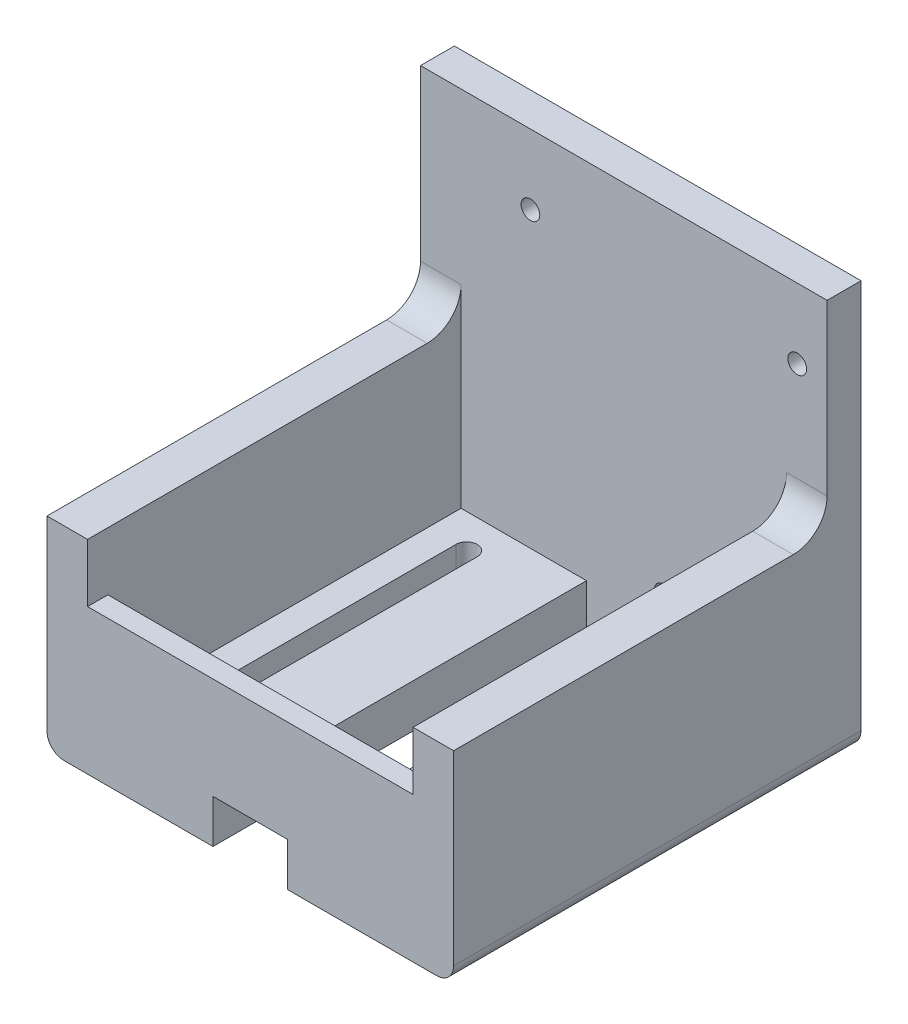
ISO-10303-21;
HEADER;
FILE_DESCRIPTION(('STEP AP214'),'2;1');
FILE_NAME('part.step','',(''),(''),'','','');
FILE_SCHEMA(('AUTOMOTIVE_DESIGN { 1 0 10303 214 1 1 1 1 }'));
ENDSEC;
DATA;
#1=APPLICATION_CONTEXT('core data for automotive mechanical design processes');
#2=APPLICATION_PROTOCOL_DEFINITION('international standard','automotive_design',2000,#1);
#3=PRODUCT_CONTEXT('',#1,'mechanical');
#4=PRODUCT('Part','Part','',(#3));
#5=PRODUCT_RELATED_PRODUCT_CATEGORY('part','',(#4));
#6=PRODUCT_DEFINITION_FORMATION('','',#4);
#7=PRODUCT_DEFINITION_CONTEXT('part definition',#1,'design');
#8=PRODUCT_DEFINITION('design','',#6,#7);
#9=PRODUCT_DEFINITION_SHAPE('','',#8);
#10=(LENGTH_UNIT() NAMED_UNIT(*) SI_UNIT(.MILLI.,.METRE.));
#11=(NAMED_UNIT(*) PLANE_ANGLE_UNIT() SI_UNIT($,.RADIAN.));
#12=(NAMED_UNIT(*) SI_UNIT($,.STERADIAN.) SOLID_ANGLE_UNIT());
#13=UNCERTAINTY_MEASURE_WITH_UNIT(LENGTH_MEASURE(1.E-05),#10,'distance_accuracy_value','');
#14=(GEOMETRIC_REPRESENTATION_CONTEXT(3) GLOBAL_UNCERTAINTY_ASSIGNED_CONTEXT((#13)) GLOBAL_UNIT_ASSIGNED_CONTEXT((#10,
#11,#12)) REPRESENTATION_CONTEXT('',''));
#15=CARTESIAN_POINT('',(0.,0.,0.));
#16=DIRECTION('',(0.,0.,1.));
#17=DIRECTION('',(1.,0.,0.));
#18=AXIS2_PLACEMENT_3D('',#15,#16,#17);
#19=CARTESIAN_POINT('',(76.2,8.1472457697771,76.350000086));
#20=DIRECTION('',(0.,1.,0.));
#21=DIRECTION('',(0.,0.,1.));
#22=AXIS2_PLACEMENT_3D('',#19,#20,#21);
#23=PLANE('',#22);
#24=DIRECTION('',(0.,0.,-1.));
#25=VECTOR('',#24,1.);
#26=CARTESIAN_POINT('',(59.22,8.1472457697771,12.7));
#27=LINE('',#26,#25);
#28=CARTESIAN_POINT('',(59.22,8.1472457697771,70.000000086));
#29=VERTEX_POINT('',#28);
#30=CARTESIAN_POINT('',(59.22,8.1472457697771,12.7));
#31=VERTEX_POINT('',#30);
#32=EDGE_CURVE('E464',#29,#31,#27,.T.);
#33=ORIENTED_EDGE('',*,*,#32,.T.);
#34=CARTESIAN_POINT('',(61.22,8.1472457697771,12.7));
#35=DIRECTION('',(0.,-1.,0.));
#36=DIRECTION('',(0.,0.,1.));
#37=AXIS2_PLACEMENT_3D('',#34,#35,#36);
#38=CIRCLE('',#37,2.);
#39=CARTESIAN_POINT('',(63.22,8.1472457697771,12.7));
#40=VERTEX_POINT('',#39);
#41=EDGE_CURVE('E460',#31,#40,#38,.T.);
#42=ORIENTED_EDGE('',*,*,#41,.T.);
#43=DIRECTION('',(0.,0.,1.));
#44=VECTOR('',#43,1.);
#45=CARTESIAN_POINT('',(63.22,8.1472457697771,12.7));
#46=LINE('',#45,#44);
#47=CARTESIAN_POINT('',(63.22,8.1472457697771,70.000000086));
#48=VERTEX_POINT('',#47);
#49=EDGE_CURVE('E481',#40,#48,#46,.T.);
#50=ORIENTED_EDGE('',*,*,#49,.T.);
#51=CARTESIAN_POINT('',(61.22,8.1472457697771,70.000000086));
#52=DIRECTION('',(0.,-1.,0.));
#53=DIRECTION('',(0.,0.,1.));
#54=AXIS2_PLACEMENT_3D('',#51,#52,#53);
#55=CIRCLE('',#54,2.);
#56=EDGE_CURVE('E477',#48,#29,#55,.T.);
#57=ORIENTED_EDGE('',*,*,#56,.T.);
#58=EDGE_LOOP('',(#33,#42,#50,#57));
#59=FACE_BOUND('',#58,.T.);
#60=DIRECTION('',(0.,0.,-1.));
#61=VECTOR('',#60,1.);
#62=CARTESIAN_POINT('',(45.1,8.1472457697771,76.350000086));
#63=LINE('',#62,#61);
#64=CARTESIAN_POINT('',(45.1,8.1472457697771,72.540000086));
#65=VERTEX_POINT('',#64);
#66=CARTESIAN_POINT('',(45.1,8.1472457697771,18.558822598954));
#67=VERTEX_POINT('',#66);
#68=EDGE_CURVE('E60',#65,#67,#63,.T.);
#69=ORIENTED_EDGE('',*,*,#68,.F.);
#70=DIRECTION('',(-1.,0.,0.));
#71=VECTOR('',#70,1.);
#72=CARTESIAN_POINT('',(7.60000000000001,8.1472457697771,72.540000086));
#73=LINE('',#72,#71);
#74=CARTESIAN_POINT('',(68.6,8.1472457697771,72.540000086));
#75=VERTEX_POINT('',#74);
#76=EDGE_CURVE('E269',#75,#65,#73,.T.);
#77=ORIENTED_EDGE('',*,*,#76,.F.);
#78=DIRECTION('',(0.,0.,-1.));
#79=VECTOR('',#78,1.);
#80=CARTESIAN_POINT('',(68.6,8.1472457697771,76.350000086));
#81=LINE('',#80,#79);
#82=CARTESIAN_POINT('',(68.6,8.1472457697771,6.35));
#83=VERTEX_POINT('',#82);
#84=EDGE_CURVE('E528',#75,#83,#81,.T.);
#85=ORIENTED_EDGE('',*,*,#84,.T.);
#86=DIRECTION('',(1.,0.,0.));
#87=VECTOR('',#86,1.);
#88=CARTESIAN_POINT('',(76.2,8.1472457697771,6.35));
#89=LINE('',#88,#87);
#90=CARTESIAN_POINT('',(48.91,8.1472457697771,6.35));
#91=VERTEX_POINT('',#90);
#92=EDGE_CURVE('E452',#91,#83,#89,.T.);
#93=ORIENTED_EDGE('',*,*,#92,.F.);
#94=DIRECTION('',(0.,0.,-1.));
#95=VECTOR('',#94,1.);
#96=CARTESIAN_POINT('',(48.91,8.1472457697771,76.350000086));
#97=LINE('',#96,#95);
#98=CARTESIAN_POINT('',(48.91,8.1472457697771,18.558822598954));
#99=VERTEX_POINT('',#98);
#100=EDGE_CURVE('E53',#91,#99,#97,.F.);
#101=ORIENTED_EDGE('',*,*,#100,.T.);
#102=DIRECTION('',(-1.,0.,0.));
#103=VECTOR('',#102,1.);
#104=CARTESIAN_POINT('',(76.2,8.1472457697771,18.558822598954));
#105=LINE('',#104,#103);
#106=EDGE_CURVE('E443',#99,#67,#105,.T.);
#107=ORIENTED_EDGE('',*,*,#106,.T.);
#108=EDGE_LOOP('',(#69,#77,#85,#93,#101,#107));
#109=FACE_BOUND('',#108,.T.);
#110=ADVANCED_FACE('F43',(#59,#109),#23,.T.);
#111=CARTESIAN_POINT('',(0.,8.1472457697771,76.350000086));
#112=DIRECTION('',(0.,-1.,0.));
#113=DIRECTION('',(0.,0.,-1.));
#114=AXIS2_PLACEMENT_3D('',#111,#112,#113);
#115=PLANE('',#114);
#116=DIRECTION('',(0.,0.,1.));
#117=VECTOR('',#116,1.);
#118=CARTESIAN_POINT('',(12.98,8.1472457697771,12.7));
#119=LINE('',#118,#117);
#120=CARTESIAN_POINT('',(12.98,8.1472457697771,12.7));
#121=VERTEX_POINT('',#120);
#122=CARTESIAN_POINT('',(12.98,8.1472457697771,70.000000086));
#123=VERTEX_POINT('',#122);
#124=EDGE_CURVE('E557',#121,#123,#119,.T.);
#125=ORIENTED_EDGE('',*,*,#124,.F.);
#126=CARTESIAN_POINT('',(14.98,8.1472457697771,12.7));
#127=DIRECTION('',(0.,1.,0.));
#128=DIRECTION('',(0.,0.,1.));
#129=AXIS2_PLACEMENT_3D('',#126,#127,#128);
#130=CIRCLE('',#129,2.);
#131=CARTESIAN_POINT('',(16.98,8.1472457697771,12.7));
#132=VERTEX_POINT('',#131);
#133=EDGE_CURVE('E554',#132,#121,#130,.T.);
#134=ORIENTED_EDGE('',*,*,#133,.F.);
#135=DIRECTION('',(0.,0.,-1.));
#136=VECTOR('',#135,1.);
#137=CARTESIAN_POINT('',(16.98,8.1472457697771,12.7));
#138=LINE('',#137,#136);
#139=CARTESIAN_POINT('',(16.98,8.1472457697771,70.000000086));
#140=VERTEX_POINT('',#139);
#141=EDGE_CURVE('E565',#140,#132,#138,.T.);
#142=ORIENTED_EDGE('',*,*,#141,.F.);
#143=CARTESIAN_POINT('',(14.98,8.1472457697771,70.000000086));
#144=DIRECTION('',(0.,1.,0.));
#145=DIRECTION('',(0.,0.,1.));
#146=AXIS2_PLACEMENT_3D('',#143,#144,#145);
#147=CIRCLE('',#146,2.);
#148=EDGE_CURVE('E561',#123,#140,#147,.T.);
#149=ORIENTED_EDGE('',*,*,#148,.F.);
#150=EDGE_LOOP('',(#125,#134,#142,#149));
#151=FACE_BOUND('',#150,.T.);
#152=CARTESIAN_POINT('',(31.1,8.1472457697771,72.540000086));
#153=VERTEX_POINT('',#152);
#154=CARTESIAN_POINT('',(7.60000000000001,8.1472457697771,72.540000086));
#155=VERTEX_POINT('',#154);
#156=EDGE_CURVE('E1031',#153,#155,#73,.T.);
#157=ORIENTED_EDGE('',*,*,#156,.F.);
#158=DIRECTION('',(0.,0.,-1.));
#159=VECTOR('',#158,1.);
#160=CARTESIAN_POINT('',(31.1,8.1472457697771,76.350000086));
#161=LINE('',#160,#159);
#162=CARTESIAN_POINT('',(31.1,8.1472457697771,6.35));
#163=VERTEX_POINT('',#162);
#164=EDGE_CURVE('E300',#153,#163,#161,.T.);
#165=ORIENTED_EDGE('',*,*,#164,.T.);
#166=DIRECTION('',(-1.,0.,0.));
#167=VECTOR('',#166,1.);
#168=CARTESIAN_POINT('',(0.,8.1472457697771,6.35));
#169=LINE('',#168,#167);
#170=CARTESIAN_POINT('',(7.60000000000001,8.1472457697771,6.35));
#171=VERTEX_POINT('',#170);
#172=EDGE_CURVE('E301',#163,#171,#169,.T.);
#173=ORIENTED_EDGE('',*,*,#172,.T.);
#174=DIRECTION('',(0.,0.,-1.));
#175=VECTOR('',#174,1.);
#176=CARTESIAN_POINT('',(7.60000000000001,8.1472457697771,76.350000086));
#177=LINE('',#176,#175);
#178=EDGE_CURVE('E320',#155,#171,#177,.T.);
#179=ORIENTED_EDGE('',*,*,#178,.F.);
#180=EDGE_LOOP('',(#157,#165,#173,#179));
#181=FACE_BOUND('',#180,.T.);
#182=ADVANCED_FACE('F609',(#151,#181),#115,.F.);
#183=CARTESIAN_POINT('',(7.60000000000001,0.,76.350000086));
#184=DIRECTION('',(-1.,0.,0.));
#185=DIRECTION('',(0.,0.,1.));
#186=AXIS2_PLACEMENT_3D('',#183,#184,#185);
#187=PLANE('',#186);
#188=DIRECTION('',(0.,-1.,0.));
#189=VECTOR('',#188,1.);
#190=CARTESIAN_POINT('',(7.60000000000001,27.1972457697771,72.540000086));
#191=LINE('',#190,#189);
#192=CARTESIAN_POINT('',(7.60000000000001,27.1972457697771,72.540000086));
#193=VERTEX_POINT('',#192);
#194=EDGE_CURVE('E466',#193,#155,#191,.T.);
#195=ORIENTED_EDGE('',*,*,#194,.T.);
#196=ORIENTED_EDGE('',*,*,#178,.T.);
#197=DIRECTION('',(0.,1.,0.));
#198=VECTOR('',#197,1.);
#199=CARTESIAN_POINT('',(7.60000000000001,0.,6.35));
#200=LINE('',#199,#198);
#201=CARTESIAN_POINT('',(7.60000000000001,44.45,6.35));
#202=VERTEX_POINT('',#201);
#203=EDGE_CURVE('E284',#171,#202,#200,.T.);
#204=ORIENTED_EDGE('',*,*,#203,.T.);
#205=CARTESIAN_POINT('',(7.60000000000001,44.45,12.7));
#206=DIRECTION('',(-1.,0.,0.));
#207=DIRECTION('',(0.,0.,1.));
#208=AXIS2_PLACEMENT_3D('',#205,#206,#207);
#209=CIRCLE('',#208,6.35);
#210=CARTESIAN_POINT('',(7.60000000000001,38.1,12.7));
#211=VERTEX_POINT('',#210);
#212=EDGE_CURVE('E407',#202,#211,#209,.T.);
#213=ORIENTED_EDGE('',*,*,#212,.T.);
#214=DIRECTION('',(0.,0.,-1.));
#215=VECTOR('',#214,1.);
#216=CARTESIAN_POINT('',(7.60000000000001,38.1,76.350000086));
#217=LINE('',#216,#215);
#218=CARTESIAN_POINT('',(7.60000000000001,38.1,76.350000086));
#219=VERTEX_POINT('',#218);
#220=EDGE_CURVE('E273',#219,#211,#217,.T.);
#221=ORIENTED_EDGE('',*,*,#220,.F.);
#222=DIRECTION('',(0.,1.,0.));
#223=VECTOR('',#222,1.);
#224=CARTESIAN_POINT('',(7.60000000000001,0.,76.350000086));
#225=LINE('',#224,#223);
#226=CARTESIAN_POINT('',(7.60000000000001,27.1972457697771,76.350000086));
#227=VERTEX_POINT('',#226);
#228=EDGE_CURVE('E252',#227,#219,#225,.T.);
#229=ORIENTED_EDGE('',*,*,#228,.F.);
#230=DIRECTION('',(0.,0.,1.));
#231=VECTOR('',#230,1.);
#232=CARTESIAN_POINT('',(7.60000000000001,27.1972457697771,76.350000086));
#233=LINE('',#232,#231);
#234=EDGE_CURVE('E259',#193,#227,#233,.T.);
#235=ORIENTED_EDGE('',*,*,#234,.F.);
#236=EDGE_LOOP('',(#195,#196,#204,#213,#221,#229,#235));
#237=FACE_BOUND('',#236,.T.);
#238=ADVANCED_FACE('F271',(#237),#187,.F.);
#239=CARTESIAN_POINT('',(68.6,0.,76.350000086));
#240=DIRECTION('',(-1.,0.,0.));
#241=DIRECTION('',(0.,0.,1.));
#242=AXIS2_PLACEMENT_3D('',#239,#240,#241);
#243=PLANE('',#242);
#244=ORIENTED_EDGE('',*,*,#84,.F.);
#245=DIRECTION('',(0.,-1.,0.));
#246=VECTOR('',#245,1.);
#247=CARTESIAN_POINT('',(68.6,27.1972457697771,72.540000086));
#248=LINE('',#247,#246);
#249=CARTESIAN_POINT('',(68.6,27.1972457697771,72.540000086));
#250=VERTEX_POINT('',#249);
#251=EDGE_CURVE('E68',#250,#75,#248,.T.);
#252=ORIENTED_EDGE('',*,*,#251,.F.);
#253=DIRECTION('',(0.,0.,-1.));
#254=VECTOR('',#253,1.);
#255=CARTESIAN_POINT('',(68.6,27.1972457697771,76.350000086));
#256=LINE('',#255,#254);
#257=CARTESIAN_POINT('',(68.6,27.1972457697771,76.350000086));
#258=VERTEX_POINT('',#257);
#259=EDGE_CURVE('E258',#258,#250,#256,.T.);
#260=ORIENTED_EDGE('',*,*,#259,.F.);
#261=DIRECTION('',(0.,1.,0.));
#262=VECTOR('',#261,1.);
#263=CARTESIAN_POINT('',(68.6,0.,76.350000086));
#264=LINE('',#263,#262);
#265=CARTESIAN_POINT('',(68.6,38.1,76.350000086));
#266=VERTEX_POINT('',#265);
#267=EDGE_CURVE('E255',#258,#266,#264,.T.);
#268=ORIENTED_EDGE('',*,*,#267,.T.);
#269=DIRECTION('',(0.,0.,-1.));
#270=VECTOR('',#269,1.);
#271=CARTESIAN_POINT('',(68.6,38.1,76.350000086));
#272=LINE('',#271,#270);
#273=CARTESIAN_POINT('',(68.6,38.1,12.7));
#274=VERTEX_POINT('',#273);
#275=EDGE_CURVE('E539',#266,#274,#272,.T.);
#276=ORIENTED_EDGE('',*,*,#275,.T.);
#277=CARTESIAN_POINT('',(68.6,44.45,12.7));
#278=DIRECTION('',(-1.,0.,0.));
#279=DIRECTION('',(0.,0.,1.));
#280=AXIS2_PLACEMENT_3D('',#277,#278,#279);
#281=CIRCLE('',#280,6.35);
#282=CARTESIAN_POINT('',(68.6,44.45,6.35));
#283=VERTEX_POINT('',#282);
#284=EDGE_CURVE('E400',#274,#283,#281,.F.);
#285=ORIENTED_EDGE('',*,*,#284,.T.);
#286=DIRECTION('',(0.,1.,0.));
#287=VECTOR('',#286,1.);
#288=CARTESIAN_POINT('',(68.6,0.,6.35));
#289=LINE('',#288,#287);
#290=EDGE_CURVE('E515',#83,#283,#289,.T.);
#291=ORIENTED_EDGE('',*,*,#290,.F.);
#292=EDGE_LOOP('',(#244,#252,#260,#268,#276,#285,#291));
#293=FACE_BOUND('',#292,.T.);
#294=ADVANCED_FACE('F641',(#293),#243,.T.);
#295=CARTESIAN_POINT('',(0.,0.,6.35));
#296=DIRECTION('',(0.,1.,0.));
#297=DIRECTION('',(0.,0.,1.));
#298=AXIS2_PLACEMENT_3D('',#295,#296,#297);
#299=PLANE('',#298);
#300=DIRECTION('',(1.,0.,0.));
#301=VECTOR('',#300,1.);
#302=CARTESIAN_POINT('',(0.,0.,76.350000086));
#303=LINE('',#302,#301);
#304=CARTESIAN_POINT('',(3.175,0.,76.350000086));
#305=VERTEX_POINT('',#304);
#306=CARTESIAN_POINT('',(31.1,0.,76.350000086));
#307=VERTEX_POINT('',#306);
#308=EDGE_CURVE('E293',#305,#307,#303,.T.);
#309=ORIENTED_EDGE('',*,*,#308,.F.);
#310=DIRECTION('',(0.,0.,-1.));
#311=VECTOR('',#310,1.);
#312=CARTESIAN_POINT('',(3.175,0.,6.35));
#313=LINE('',#312,#311);
#314=CARTESIAN_POINT('',(3.175,0.,0.));
#315=VERTEX_POINT('',#314);
#316=EDGE_CURVE('E413',#305,#315,#313,.T.);
#317=ORIENTED_EDGE('',*,*,#316,.T.);
#318=DIRECTION('',(1.,0.,0.));
#319=VECTOR('',#318,1.);
#320=CARTESIAN_POINT('',(0.,0.,0.));
#321=LINE('',#320,#319);
#322=CARTESIAN_POINT('',(73.025,0.,0.));
#323=VERTEX_POINT('',#322);
#324=EDGE_CURVE('E366',#315,#323,#321,.T.);
#325=ORIENTED_EDGE('',*,*,#324,.T.);
#326=DIRECTION('',(0.,0.,-1.));
#327=VECTOR('',#326,1.);
#328=CARTESIAN_POINT('',(73.025,0.,6.35));
#329=LINE('',#328,#327);
#330=CARTESIAN_POINT('',(73.025,0.,76.350000086));
#331=VERTEX_POINT('',#330);
#332=EDGE_CURVE('E410',#323,#331,#329,.F.);
#333=ORIENTED_EDGE('',*,*,#332,.T.);
#334=DIRECTION('',(-1.,0.,0.));
#335=VECTOR('',#334,1.);
#336=CARTESIAN_POINT('',(76.2,0.,76.350000086));
#337=LINE('',#336,#335);
#338=CARTESIAN_POINT('',(45.1,0.,76.350000086));
#339=VERTEX_POINT('',#338);
#340=EDGE_CURVE('E514',#331,#339,#337,.T.);
#341=ORIENTED_EDGE('',*,*,#340,.T.);
#342=DIRECTION('',(0.,0.,-1.));
#343=VECTOR('',#342,1.);
#344=CARTESIAN_POINT('',(45.1,0.,76.350000086));
#345=LINE('',#344,#343);
#346=CARTESIAN_POINT('',(45.1,0.,6.35));
#347=VERTEX_POINT('',#346);
#348=EDGE_CURVE('E547',#339,#347,#345,.T.);
#349=ORIENTED_EDGE('',*,*,#348,.T.);
#350=DIRECTION('',(1.,0.,0.));
#351=VECTOR('',#350,1.);
#352=CARTESIAN_POINT('',(0.,0.,6.35));
#353=LINE('',#352,#351);
#354=CARTESIAN_POINT('',(31.1,0.,6.35));
#355=VERTEX_POINT('',#354);
#356=EDGE_CURVE('E352',#355,#347,#353,.T.);
#357=ORIENTED_EDGE('',*,*,#356,.F.);
#358=DIRECTION('',(0.,0.,-1.));
#359=VECTOR('',#358,1.);
#360=CARTESIAN_POINT('',(31.1,0.,76.350000086));
#361=LINE('',#360,#359);
#362=EDGE_CURVE('E310',#307,#355,#361,.T.);
#363=ORIENTED_EDGE('',*,*,#362,.F.);
#364=EDGE_LOOP('',(#309,#317,#325,#333,#341,#349,#357,#363));
#365=FACE_BOUND('',#364,.T.);
#366=DIRECTION('',(0.,0.,-1.));
#367=VECTOR('',#366,1.);
#368=CARTESIAN_POINT('',(16.98,0.,6.35));
#369=LINE('',#368,#367);
#370=CARTESIAN_POINT('',(16.98,0.,70.000000086));
#371=VERTEX_POINT('',#370);
#372=CARTESIAN_POINT('',(16.98,0.,12.7));
#373=VERTEX_POINT('',#372);
#374=EDGE_CURVE('E589',#371,#373,#369,.T.);
#375=ORIENTED_EDGE('',*,*,#374,.T.);
#376=CARTESIAN_POINT('',(14.98,0.,12.7));
#377=DIRECTION('',(0.,1.,0.));
#378=DIRECTION('',(0.,0.,1.));
#379=AXIS2_PLACEMENT_3D('',#376,#377,#378);
#380=CIRCLE('',#379,2.);
#381=CARTESIAN_POINT('',(12.98,0.,12.7));
#382=VERTEX_POINT('',#381);
#383=EDGE_CURVE('E287',#373,#382,#380,.T.);
#384=ORIENTED_EDGE('',*,*,#383,.T.);
#385=DIRECTION('',(0.,0.,1.));
#386=VECTOR('',#385,1.);
#387=CARTESIAN_POINT('',(12.98,0.,6.35));
#388=LINE('',#387,#386);
#389=CARTESIAN_POINT('',(12.98,0.,70.000000086));
#390=VERTEX_POINT('',#389);
#391=EDGE_CURVE('E573',#382,#390,#388,.T.);
#392=ORIENTED_EDGE('',*,*,#391,.T.);
#393=CARTESIAN_POINT('',(14.98,0.,70.000000086));
#394=DIRECTION('',(0.,1.,0.));
#395=DIRECTION('',(0.,0.,1.));
#396=AXIS2_PLACEMENT_3D('',#393,#394,#395);
#397=CIRCLE('',#396,2.);
#398=EDGE_CURVE('E586',#390,#371,#397,.T.);
#399=ORIENTED_EDGE('',*,*,#398,.T.);
#400=EDGE_LOOP('',(#375,#384,#392,#399));
#401=FACE_BOUND('',#400,.T.);
#402=CARTESIAN_POINT('',(61.22,0.,12.7));
#403=DIRECTION('',(0.,1.,0.));
#404=DIRECTION('',(0.,0.,1.));
#405=AXIS2_PLACEMENT_3D('',#402,#403,#404);
#406=CIRCLE('',#405,2.);
#407=CARTESIAN_POINT('',(59.22,0.,12.7));
#408=VERTEX_POINT('',#407);
#409=CARTESIAN_POINT('',(63.22,0.,12.7));
#410=VERTEX_POINT('',#409);
#411=EDGE_CURVE('E508',#408,#410,#406,.F.);
#412=ORIENTED_EDGE('',*,*,#411,.F.);
#413=DIRECTION('',(0.,0.,-1.));
#414=VECTOR('',#413,1.);
#415=CARTESIAN_POINT('',(59.22,0.,6.35000000000001));
#416=LINE('',#415,#414);
#417=CARTESIAN_POINT('',(59.22,0.,70.000000086));
#418=VERTEX_POINT('',#417);
#419=EDGE_CURVE('E489',#418,#408,#416,.T.);
#420=ORIENTED_EDGE('',*,*,#419,.F.);
#421=CARTESIAN_POINT('',(61.22,0.,70.000000086));
#422=DIRECTION('',(0.,1.,0.));
#423=DIRECTION('',(0.,0.,1.));
#424=AXIS2_PLACEMENT_3D('',#421,#422,#423);
#425=CIRCLE('',#424,2.);
#426=CARTESIAN_POINT('',(63.22,0.,70.000000086));
#427=VERTEX_POINT('',#426);
#428=EDGE_CURVE('E501',#427,#418,#425,.F.);
#429=ORIENTED_EDGE('',*,*,#428,.F.);
#430=DIRECTION('',(0.,0.,1.));
#431=VECTOR('',#430,1.);
#432=CARTESIAN_POINT('',(63.22,0.,6.35000000000001));
#433=LINE('',#432,#431);
#434=EDGE_CURVE('E505',#410,#427,#433,.T.);
#435=ORIENTED_EDGE('',*,*,#434,.F.);
#436=EDGE_LOOP('',(#412,#420,#429,#435));
#437=FACE_BOUND('',#436,.T.);
#438=ADVANCED_FACE('F595',(#365,#401,#437),#299,.F.);
#439=CARTESIAN_POINT('',(0.,0.,6.35));
#440=DIRECTION('',(0.,0.,-1.));
#441=DIRECTION('',(-1.,0.,0.));
#442=AXIS2_PLACEMENT_3D('',#439,#440,#441);
#443=PLANE('',#442);
#444=ORIENTED_EDGE('',*,*,#290,.T.);
#445=DIRECTION('',(1.,0.,0.));
#446=VECTOR('',#445,1.);
#447=CARTESIAN_POINT('',(0.,44.45,6.35));
#448=LINE('',#447,#446);
#449=CARTESIAN_POINT('',(76.2,44.45,6.35));
#450=VERTEX_POINT('',#449);
#451=EDGE_CURVE('E386',#283,#450,#448,.T.);
#452=ORIENTED_EDGE('',*,*,#451,.T.);
#453=DIRECTION('',(0.,1.,0.));
#454=VECTOR('',#453,1.);
#455=CARTESIAN_POINT('',(76.2,0.,6.35));
#456=LINE('',#455,#454);
#457=CARTESIAN_POINT('',(76.2,76.2,6.35));
#458=VERTEX_POINT('',#457);
#459=EDGE_CURVE('E356',#450,#458,#456,.T.);
#460=ORIENTED_EDGE('',*,*,#459,.T.);
#461=DIRECTION('',(-1.,0.,0.));
#462=VECTOR('',#461,1.);
#463=CARTESIAN_POINT('',(0.,76.2,6.35));
#464=LINE('',#463,#462);
#465=CARTESIAN_POINT('',(0.,76.2,6.35));
#466=VERTEX_POINT('',#465);
#467=EDGE_CURVE('E359',#458,#466,#464,.T.);
#468=ORIENTED_EDGE('',*,*,#467,.T.);
#469=DIRECTION('',(0.,-1.,0.));
#470=VECTOR('',#469,1.);
#471=CARTESIAN_POINT('',(0.,0.,6.35));
#472=LINE('',#471,#470);
#473=CARTESIAN_POINT('',(0.,44.45,6.35));
#474=VERTEX_POINT('',#473);
#475=EDGE_CURVE('E348',#466,#474,#472,.T.);
#476=ORIENTED_EDGE('',*,*,#475,.T.);
#477=DIRECTION('',(-1.,0.,0.));
#478=VECTOR('',#477,1.);
#479=CARTESIAN_POINT('',(7.60000000000001,44.45,6.35));
#480=LINE('',#479,#478);
#481=EDGE_CURVE('E382',#474,#202,#480,.F.);
#482=ORIENTED_EDGE('',*,*,#481,.T.);
#483=ORIENTED_EDGE('',*,*,#203,.F.);
#484=ORIENTED_EDGE('',*,*,#172,.F.);
#485=DIRECTION('',(0.,1.,0.));
#486=VECTOR('',#485,1.);
#487=CARTESIAN_POINT('',(31.1,0.,6.35));
#488=LINE('',#487,#486);
#489=EDGE_CURVE('E277',#355,#163,#488,.T.);
#490=ORIENTED_EDGE('',*,*,#489,.F.);
#491=ORIENTED_EDGE('',*,*,#356,.T.);
#492=DIRECTION('',(0.,1.,0.));
#493=VECTOR('',#492,1.);
#494=CARTESIAN_POINT('',(45.1,0.,6.35));
#495=LINE('',#494,#493);
#496=CARTESIAN_POINT('',(45.1,4.3372457697771,6.35));
#497=VERTEX_POINT('',#496);
#498=EDGE_CURVE('E531',#347,#497,#495,.T.);
#499=ORIENTED_EDGE('',*,*,#498,.T.);
#500=CARTESIAN_POINT('',(48.91,4.3372457697771,6.34999999999999));
#501=DIRECTION('',(0.,0.,-1.));
#502=DIRECTION('',(-1.,0.,0.));
#503=AXIS2_PLACEMENT_3D('',#500,#501,#502);
#504=CIRCLE('',#503,3.81);
#505=EDGE_CURVE('E11',#497,#91,#504,.T.);
#506=ORIENTED_EDGE('',*,*,#505,.T.);
#507=ORIENTED_EDGE('',*,*,#92,.T.);
#508=EDGE_LOOP('',(#444,#452,#460,#468,#476,#482,#483,#484,#490,#491,#499,#506,#507));
#509=FACE_BOUND('',#508,.T.);
#510=CARTESIAN_POINT('',(45.6,13.1,6.35));
#511=DIRECTION('',(0.,0.,1.));
#512=DIRECTION('',(1.,0.,0.));
#513=AXIS2_PLACEMENT_3D('',#510,#511,#512);
#514=CIRCLE('',#513,1.75);
#515=CARTESIAN_POINT('',(47.35,13.1,6.35));
#516=VERTEX_POINT('',#515);
#517=EDGE_CURVE('E341',#516,#516,#514,.T.);
#518=ORIENTED_EDGE('',*,*,#517,.F.);
#519=EDGE_LOOP('',(#518));
#520=FACE_BOUND('',#519,.T.);
#521=CARTESIAN_POINT('',(70.6,63.1,6.35));
#522=DIRECTION('',(0.,0.,1.));
#523=DIRECTION('',(1.,0.,0.));
#524=AXIS2_PLACEMENT_3D('',#521,#522,#523);
#525=CIRCLE('',#524,1.75);
#526=CARTESIAN_POINT('',(72.35,63.1,6.35));
#527=VERTEX_POINT('',#526);
#528=EDGE_CURVE('E333',#527,#527,#525,.T.);
#529=ORIENTED_EDGE('',*,*,#528,.F.);
#530=EDGE_LOOP('',(#529));
#531=FACE_BOUND('',#530,.T.);
#532=CARTESIAN_POINT('',(20.6,63.1,6.35));
#533=DIRECTION('',(0.,0.,1.));
#534=DIRECTION('',(1.,0.,0.));
#535=AXIS2_PLACEMENT_3D('',#532,#533,#534);
#536=CIRCLE('',#535,1.75);
#537=CARTESIAN_POINT('',(22.35,63.1,6.35));
#538=VERTEX_POINT('',#537);
#539=EDGE_CURVE('E329',#538,#538,#536,.T.);
#540=ORIENTED_EDGE('',*,*,#539,.F.);
#541=EDGE_LOOP('',(#540));
#542=FACE_BOUND('',#541,.T.);
#543=ADVANCED_FACE('F845',(#509,#520,#531,#542),#443,.F.);
#544=CARTESIAN_POINT('',(0.,0.,6.35));
#545=DIRECTION('',(1.,0.,0.));
#546=DIRECTION('',(0.,0.,-1.));
#547=AXIS2_PLACEMENT_3D('',#544,#545,#546);
#548=PLANE('',#547);
#549=DIRECTION('',(0.,-1.,0.));
#550=VECTOR('',#549,1.);
#551=CARTESIAN_POINT('',(0.,0.,0.));
#552=LINE('',#551,#550);
#553=CARTESIAN_POINT('',(0.,76.2,0.));
#554=VERTEX_POINT('',#553);
#555=CARTESIAN_POINT('',(0.,3.175,0.));
#556=VERTEX_POINT('',#555);
#557=EDGE_CURVE('E328',#554,#556,#552,.T.);
#558=ORIENTED_EDGE('',*,*,#557,.T.);
#559=DIRECTION('',(0.,0.,-1.));
#560=VECTOR('',#559,1.);
#561=CARTESIAN_POINT('',(0.,3.175,6.35));
#562=LINE('',#561,#560);
#563=CARTESIAN_POINT('',(0.,3.175,76.350000086));
#564=VERTEX_POINT('',#563);
#565=EDGE_CURVE('E423',#556,#564,#562,.F.);
#566=ORIENTED_EDGE('',*,*,#565,.T.);
#567=DIRECTION('',(0.,-1.,0.));
#568=VECTOR('',#567,1.);
#569=CARTESIAN_POINT('',(0.,0.,76.350000086));
#570=LINE('',#569,#568);
#571=CARTESIAN_POINT('',(0.,38.1,76.350000086));
#572=VERTEX_POINT('',#571);
#573=EDGE_CURVE('E281',#572,#564,#570,.T.);
#574=ORIENTED_EDGE('',*,*,#573,.F.);
#575=DIRECTION('',(0.,0.,-1.));
#576=VECTOR('',#575,1.);
#577=CARTESIAN_POINT('',(0.,38.1,76.350000086));
#578=LINE('',#577,#576);
#579=CARTESIAN_POINT('',(0.,38.1,12.7));
#580=VERTEX_POINT('',#579);
#581=EDGE_CURVE('E314',#572,#580,#578,.T.);
#582=ORIENTED_EDGE('',*,*,#581,.T.);
#583=CARTESIAN_POINT('',(0.,44.45,12.7));
#584=DIRECTION('',(1.,0.,0.));
#585=DIRECTION('',(0.,0.,-1.));
#586=AXIS2_PLACEMENT_3D('',#583,#584,#585);
#587=CIRCLE('',#586,6.35);
#588=EDGE_CURVE('E404',#580,#474,#587,.T.);
#589=ORIENTED_EDGE('',*,*,#588,.T.);
#590=ORIENTED_EDGE('',*,*,#475,.F.);
#591=DIRECTION('',(0.,0.,-1.));
#592=VECTOR('',#591,1.);
#593=CARTESIAN_POINT('',(0.,76.2,6.35));
#594=LINE('',#593,#592);
#595=EDGE_CURVE('E362',#466,#554,#594,.T.);
#596=ORIENTED_EDGE('',*,*,#595,.T.);
#597=EDGE_LOOP('',(#558,#566,#574,#582,#589,#590,#596));
#598=FACE_BOUND('',#597,.T.);
#599=ADVANCED_FACE('F838',(#598),#548,.F.);
#600=CARTESIAN_POINT('',(76.2,0.,6.35));
#601=DIRECTION('',(-1.,0.,0.));
#602=DIRECTION('',(0.,0.,1.));
#603=AXIS2_PLACEMENT_3D('',#600,#601,#602);
#604=PLANE('',#603);
#605=DIRECTION('',(0.,-1.,0.));
#606=VECTOR('',#605,1.);
#607=CARTESIAN_POINT('',(76.2,0.,76.350000086));
#608=LINE('',#607,#606);
#609=CARTESIAN_POINT('',(76.2,38.1,76.350000086));
#610=VERTEX_POINT('',#609);
#611=CARTESIAN_POINT('',(76.2,3.175,76.350000086));
#612=VERTEX_POINT('',#611);
#613=EDGE_CURVE('E518',#610,#612,#608,.T.);
#614=ORIENTED_EDGE('',*,*,#613,.T.);
#615=DIRECTION('',(0.,0.,-1.));
#616=VECTOR('',#615,1.);
#617=CARTESIAN_POINT('',(76.2,3.175,6.35));
#618=LINE('',#617,#616);
#619=CARTESIAN_POINT('',(76.2,3.175,0.));
#620=VERTEX_POINT('',#619);
#621=EDGE_CURVE('E429',#612,#620,#618,.T.);
#622=ORIENTED_EDGE('',*,*,#621,.T.);
#623=DIRECTION('',(0.,1.,0.));
#624=VECTOR('',#623,1.);
#625=CARTESIAN_POINT('',(76.2,0.,0.));
#626=LINE('',#625,#624);
#627=CARTESIAN_POINT('',(76.2,76.2,0.));
#628=VERTEX_POINT('',#627);
#629=EDGE_CURVE('E370',#620,#628,#626,.T.);
#630=ORIENTED_EDGE('',*,*,#629,.T.);
#631=DIRECTION('',(0.,0.,-1.));
#632=VECTOR('',#631,1.);
#633=CARTESIAN_POINT('',(76.2,76.2,6.35));
#634=LINE('',#633,#632);
#635=EDGE_CURVE('E378',#458,#628,#634,.T.);
#636=ORIENTED_EDGE('',*,*,#635,.F.);
#637=ORIENTED_EDGE('',*,*,#459,.F.);
#638=CARTESIAN_POINT('',(76.2,44.45,12.7));
#639=DIRECTION('',(-1.,0.,0.));
#640=DIRECTION('',(0.,0.,1.));
#641=AXIS2_PLACEMENT_3D('',#638,#639,#640);
#642=CIRCLE('',#641,6.35);
#643=CARTESIAN_POINT('',(76.2,38.1,12.7));
#644=VERTEX_POINT('',#643);
#645=EDGE_CURVE('E397',#450,#644,#642,.T.);
#646=ORIENTED_EDGE('',*,*,#645,.T.);
#647=DIRECTION('',(0.,0.,-1.));
#648=VECTOR('',#647,1.);
#649=CARTESIAN_POINT('',(76.2,38.1,76.350000086));
#650=LINE('',#649,#648);
#651=EDGE_CURVE('E543',#610,#644,#650,.T.);
#652=ORIENTED_EDGE('',*,*,#651,.F.);
#653=EDGE_LOOP('',(#614,#622,#630,#636,#637,#646,#652));
#654=FACE_BOUND('',#653,.T.);
#655=ADVANCED_FACE('F818',(#654),#604,.F.);
#656=CARTESIAN_POINT('',(0.,76.2,6.35));
#657=DIRECTION('',(0.,-1.,0.));
#658=DIRECTION('',(0.,0.,-1.));
#659=AXIS2_PLACEMENT_3D('',#656,#657,#658);
#660=PLANE('',#659);
#661=DIRECTION('',(-1.,0.,0.));
#662=VECTOR('',#661,1.);
#663=CARTESIAN_POINT('',(0.,76.2,0.));
#664=LINE('',#663,#662);
#665=EDGE_CURVE('E353',#628,#554,#664,.T.);
#666=ORIENTED_EDGE('',*,*,#665,.T.);
#667=ORIENTED_EDGE('',*,*,#595,.F.);
#668=ORIENTED_EDGE('',*,*,#467,.F.);
#669=ORIENTED_EDGE('',*,*,#635,.T.);
#670=EDGE_LOOP('',(#666,#667,#668,#669));
#671=FACE_BOUND('',#670,.T.);
#672=ADVANCED_FACE('F814',(#671),#660,.F.);
#673=CARTESIAN_POINT('',(0.,0.,0.));
#674=DIRECTION('',(0.,0.,-1.));
#675=DIRECTION('',(-1.,0.,0.));
#676=AXIS2_PLACEMENT_3D('',#673,#674,#675);
#677=PLANE('',#676);
#678=CARTESIAN_POINT('',(20.6,63.1,0.));
#679=DIRECTION('',(0.,0.,1.));
#680=DIRECTION('',(1.,0.,0.));
#681=AXIS2_PLACEMENT_3D('',#678,#679,#680);
#682=CIRCLE('',#681,1.75);
#683=CARTESIAN_POINT('',(22.35,63.1,0.));
#684=VERTEX_POINT('',#683);
#685=EDGE_CURVE('E324',#684,#684,#682,.T.);
#686=ORIENTED_EDGE('',*,*,#685,.T.);
#687=EDGE_LOOP('',(#686));
#688=FACE_BOUND('',#687,.T.);
#689=CARTESIAN_POINT('',(70.6,63.1,0.));
#690=DIRECTION('',(0.,0.,1.));
#691=DIRECTION('',(1.,0.,0.));
#692=AXIS2_PLACEMENT_3D('',#689,#690,#691);
#693=CIRCLE('',#692,1.75);
#694=CARTESIAN_POINT('',(72.35,63.1,0.));
#695=VERTEX_POINT('',#694);
#696=EDGE_CURVE('E337',#695,#695,#693,.T.);
#697=ORIENTED_EDGE('',*,*,#696,.T.);
#698=EDGE_LOOP('',(#697));
#699=FACE_BOUND('',#698,.T.);
#700=CARTESIAN_POINT('',(45.6,13.1,0.));
#701=DIRECTION('',(0.,0.,1.));
#702=DIRECTION('',(1.,0.,0.));
#703=AXIS2_PLACEMENT_3D('',#700,#701,#702);
#704=CIRCLE('',#703,1.75);
#705=CARTESIAN_POINT('',(47.35,13.1,0.));
#706=VERTEX_POINT('',#705);
#707=EDGE_CURVE('E323',#706,#706,#704,.T.);
#708=ORIENTED_EDGE('',*,*,#707,.T.);
#709=EDGE_LOOP('',(#708));
#710=FACE_BOUND('',#709,.T.);
#711=ORIENTED_EDGE('',*,*,#324,.F.);
#712=CARTESIAN_POINT('',(3.175,3.175,0.));
#713=DIRECTION('',(0.,0.,-1.));
#714=DIRECTION('',(-1.,0.,0.));
#715=AXIS2_PLACEMENT_3D('',#712,#713,#714);
#716=CIRCLE('',#715,3.175);
#717=EDGE_CURVE('E420',#315,#556,#716,.T.);
#718=ORIENTED_EDGE('',*,*,#717,.T.);
#719=ORIENTED_EDGE('',*,*,#557,.F.);
#720=ORIENTED_EDGE('',*,*,#665,.F.);
#721=ORIENTED_EDGE('',*,*,#629,.F.);
#722=CARTESIAN_POINT('',(73.025,3.175,0.));
#723=DIRECTION('',(0.,0.,-1.));
#724=DIRECTION('',(-1.,0.,0.));
#725=AXIS2_PLACEMENT_3D('',#722,#723,#724);
#726=CIRCLE('',#725,3.175);
#727=EDGE_CURVE('E417',#620,#323,#726,.T.);
#728=ORIENTED_EDGE('',*,*,#727,.T.);
#729=EDGE_LOOP('',(#711,#718,#719,#720,#721,#728));
#730=FACE_BOUND('',#729,.T.);
#731=ADVANCED_FACE('F806',(#688,#699,#710,#730),#677,.T.);
#732=CARTESIAN_POINT('',(45.6,13.1,0.));
#733=DIRECTION('',(0.,0.,1.));
#734=DIRECTION('',(1.,0.,0.));
#735=AXIS2_PLACEMENT_3D('',#732,#733,#734);
#736=CYLINDRICAL_SURFACE('',#735,1.75);
#737=ORIENTED_EDGE('',*,*,#707,.F.);
#738=EDGE_LOOP('',(#737));
#739=FACE_BOUND('',#738,.T.);
#740=ORIENTED_EDGE('',*,*,#517,.T.);
#741=EDGE_LOOP('',(#740));
#742=FACE_BOUND('',#741,.T.);
#743=ADVANCED_FACE('F796',(#739,#742),#736,.F.);
#744=CARTESIAN_POINT('',(70.6,63.1,0.));
#745=DIRECTION('',(0.,0.,1.));
#746=DIRECTION('',(1.,0.,0.));
#747=AXIS2_PLACEMENT_3D('',#744,#745,#746);
#748=CYLINDRICAL_SURFACE('',#747,1.75);
#749=ORIENTED_EDGE('',*,*,#696,.F.);
#750=EDGE_LOOP('',(#749));
#751=FACE_BOUND('',#750,.T.);
#752=ORIENTED_EDGE('',*,*,#528,.T.);
#753=EDGE_LOOP('',(#752));
#754=FACE_BOUND('',#753,.T.);
#755=ADVANCED_FACE('F784',(#751,#754),#748,.F.);
#756=CARTESIAN_POINT('',(20.6,63.1,0.));
#757=DIRECTION('',(0.,0.,1.));
#758=DIRECTION('',(1.,0.,0.));
#759=AXIS2_PLACEMENT_3D('',#756,#757,#758);
#760=CYLINDRICAL_SURFACE('',#759,1.75);
#761=ORIENTED_EDGE('',*,*,#685,.F.);
#762=EDGE_LOOP('',(#761));
#763=FACE_BOUND('',#762,.T.);
#764=ORIENTED_EDGE('',*,*,#539,.T.);
#765=EDGE_LOOP('',(#764));
#766=FACE_BOUND('',#765,.T.);
#767=ADVANCED_FACE('F778',(#763,#766),#760,.F.);
#768=CARTESIAN_POINT('',(0.,38.1,76.350000086));
#769=DIRECTION('',(0.,-1.,0.));
#770=DIRECTION('',(0.,0.,-1.));
#771=AXIS2_PLACEMENT_3D('',#768,#769,#770);
#772=PLANE('',#771);
#773=ORIENTED_EDGE('',*,*,#220,.T.);
#774=DIRECTION('',(-1.,0.,0.));
#775=VECTOR('',#774,1.);
#776=CARTESIAN_POINT('',(0.,38.1,12.7));
#777=LINE('',#776,#775);
#778=EDGE_CURVE('E393',#211,#580,#777,.T.);
#779=ORIENTED_EDGE('',*,*,#778,.T.);
#780=ORIENTED_EDGE('',*,*,#581,.F.);
#781=DIRECTION('',(-1.,0.,0.));
#782=VECTOR('',#781,1.);
#783=CARTESIAN_POINT('',(0.,38.1,76.350000086));
#784=LINE('',#783,#782);
#785=EDGE_CURVE('E276',#219,#572,#784,.T.);
#786=ORIENTED_EDGE('',*,*,#785,.F.);
#787=EDGE_LOOP('',(#773,#779,#780,#786));
#788=FACE_BOUND('',#787,.T.);
#789=ADVANCED_FACE('F783',(#788),#772,.F.);
#790=CARTESIAN_POINT('',(31.1,0.,76.350000086));
#791=DIRECTION('',(-1.,0.,0.));
#792=DIRECTION('',(0.,0.,1.));
#793=AXIS2_PLACEMENT_3D('',#790,#791,#792);
#794=PLANE('',#793);
#795=ORIENTED_EDGE('',*,*,#489,.T.);
#796=ORIENTED_EDGE('',*,*,#164,.F.);
#797=CARTESIAN_POINT('',(31.1,8.1472457697771,76.350000086));
#798=VERTEX_POINT('',#797);
#799=EDGE_CURVE('E307',#798,#153,#161,.T.);
#800=ORIENTED_EDGE('',*,*,#799,.F.);
#801=DIRECTION('',(0.,1.,0.));
#802=VECTOR('',#801,1.);
#803=CARTESIAN_POINT('',(31.1,0.,76.350000086));
#804=LINE('',#803,#802);
#805=EDGE_CURVE('E296',#307,#798,#804,.T.);
#806=ORIENTED_EDGE('',*,*,#805,.F.);
#807=ORIENTED_EDGE('',*,*,#362,.T.);
#808=EDGE_LOOP('',(#795,#796,#800,#806,#807));
#809=FACE_BOUND('',#808,.T.);
#810=ADVANCED_FACE('F885',(#809),#794,.F.);
#811=CARTESIAN_POINT('',(0.,0.,76.350000086));
#812=DIRECTION('',(0.,0.,1.));
#813=DIRECTION('',(1.,0.,0.));
#814=AXIS2_PLACEMENT_3D('',#811,#812,#813);
#815=PLANE('',#814);
#816=DIRECTION('',(1.,0.,0.));
#817=VECTOR('',#816,1.);
#818=CARTESIAN_POINT('',(7.60000000000001,27.1972457697771,76.350000086));
#819=LINE('',#818,#817);
#820=EDGE_CURVE('E248',#227,#258,#819,.T.);
#821=ORIENTED_EDGE('',*,*,#820,.F.);
#822=ORIENTED_EDGE('',*,*,#228,.T.);
#823=ORIENTED_EDGE('',*,*,#785,.T.);
#824=ORIENTED_EDGE('',*,*,#573,.T.);
#825=CARTESIAN_POINT('',(3.175,3.175,76.350000086));
#826=DIRECTION('',(0.,0.,1.));
#827=DIRECTION('',(1.,0.,0.));
#828=AXIS2_PLACEMENT_3D('',#825,#826,#827);
#829=CIRCLE('',#828,3.175);
#830=EDGE_CURVE('E426',#564,#305,#829,.T.);
#831=ORIENTED_EDGE('',*,*,#830,.T.);
#832=ORIENTED_EDGE('',*,*,#308,.T.);
#833=ORIENTED_EDGE('',*,*,#805,.T.);
#834=DIRECTION('',(1.,0.,0.));
#835=VECTOR('',#834,1.);
#836=CARTESIAN_POINT('',(7.60000000000001,8.1472457697771,76.350000086));
#837=LINE('',#836,#835);
#838=CARTESIAN_POINT('',(45.1,8.1472457697771,76.350000086));
#839=VERTEX_POINT('',#838);
#840=EDGE_CURVE('E1024',#798,#839,#837,.T.);
#841=ORIENTED_EDGE('',*,*,#840,.T.);
#842=DIRECTION('',(0.,1.,0.));
#843=VECTOR('',#842,1.);
#844=CARTESIAN_POINT('',(45.1,0.,76.350000086));
#845=LINE('',#844,#843);
#846=EDGE_CURVE('E511',#339,#839,#845,.T.);
#847=ORIENTED_EDGE('',*,*,#846,.F.);
#848=ORIENTED_EDGE('',*,*,#340,.F.);
#849=CARTESIAN_POINT('',(73.025,3.175,76.350000086));
#850=DIRECTION('',(0.,0.,1.));
#851=DIRECTION('',(1.,0.,0.));
#852=AXIS2_PLACEMENT_3D('',#849,#850,#851);
#853=CIRCLE('',#852,3.175);
#854=EDGE_CURVE('E433',#331,#612,#853,.T.);
#855=ORIENTED_EDGE('',*,*,#854,.T.);
#856=ORIENTED_EDGE('',*,*,#613,.F.);
#857=DIRECTION('',(1.,0.,0.));
#858=VECTOR('',#857,1.);
#859=CARTESIAN_POINT('',(76.2,38.1,76.350000086));
#860=LINE('',#859,#858);
#861=EDGE_CURVE('E522',#266,#610,#860,.T.);
#862=ORIENTED_EDGE('',*,*,#861,.F.);
#863=ORIENTED_EDGE('',*,*,#267,.F.);
#864=EDGE_LOOP('',(#821,#822,#823,#824,#831,#832,#833,#841,#847,#848,#855,#856,#862,#863));
#865=FACE_BOUND('',#864,.T.);
#866=ADVANCED_FACE('F250',(#865),#815,.T.);
#867=CARTESIAN_POINT('',(14.98,-81.8527542302229,12.7));
#868=DIRECTION('',(0.,1.,0.));
#869=DIRECTION('',(0.,0.,1.));
#870=AXIS2_PLACEMENT_3D('',#867,#868,#869);
#871=CYLINDRICAL_SURFACE('',#870,2.);
#872=DIRECTION('',(0.,1.,0.));
#873=VECTOR('',#872,1.);
#874=CARTESIAN_POINT('',(16.98,-81.8527542302229,12.7));
#875=LINE('',#874,#873);
#876=EDGE_CURVE('E570',#373,#132,#875,.T.);
#877=ORIENTED_EDGE('',*,*,#876,.T.);
#878=ORIENTED_EDGE('',*,*,#133,.T.);
#879=DIRECTION('',(0.,1.,0.));
#880=VECTOR('',#879,1.);
#881=CARTESIAN_POINT('',(12.98,-81.8527542302229,12.7));
#882=LINE('',#881,#880);
#883=EDGE_CURVE('E569',#382,#121,#882,.T.);
#884=ORIENTED_EDGE('',*,*,#883,.F.);
#885=ORIENTED_EDGE('',*,*,#383,.F.);
#886=EDGE_LOOP('',(#877,#878,#884,#885));
#887=FACE_BOUND('',#886,.T.);
#888=ADVANCED_FACE('F600',(#887),#871,.F.);
#889=CARTESIAN_POINT('',(16.98,-81.8527542302229,12.7));
#890=DIRECTION('',(1.,0.,0.));
#891=DIRECTION('',(0.,0.,-1.));
#892=AXIS2_PLACEMENT_3D('',#889,#890,#891);
#893=PLANE('',#892);
#894=DIRECTION('',(0.,1.,0.));
#895=VECTOR('',#894,1.);
#896=CARTESIAN_POINT('',(16.98,-81.8527542302229,70.000000086));
#897=LINE('',#896,#895);
#898=EDGE_CURVE('E574',#371,#140,#897,.T.);
#899=ORIENTED_EDGE('',*,*,#898,.T.);
#900=ORIENTED_EDGE('',*,*,#141,.T.);
#901=ORIENTED_EDGE('',*,*,#876,.F.);
#902=ORIENTED_EDGE('',*,*,#374,.F.);
#903=EDGE_LOOP('',(#899,#900,#901,#902));
#904=FACE_BOUND('',#903,.T.);
#905=ADVANCED_FACE('F602',(#904),#893,.F.);
#906=CARTESIAN_POINT('',(14.98,-81.8527542302229,70.000000086));
#907=DIRECTION('',(0.,1.,0.));
#908=DIRECTION('',(0.,0.,1.));
#909=AXIS2_PLACEMENT_3D('',#906,#907,#908);
#910=CYLINDRICAL_SURFACE('',#909,2.);
#911=DIRECTION('',(0.,1.,0.));
#912=VECTOR('',#911,1.);
#913=CARTESIAN_POINT('',(12.98,-81.8527542302229,70.000000086));
#914=LINE('',#913,#912);
#915=EDGE_CURVE('E577',#390,#123,#914,.T.);
#916=ORIENTED_EDGE('',*,*,#915,.T.);
#917=ORIENTED_EDGE('',*,*,#148,.T.);
#918=ORIENTED_EDGE('',*,*,#898,.F.);
#919=ORIENTED_EDGE('',*,*,#398,.F.);
#920=EDGE_LOOP('',(#916,#917,#918,#919));
#921=FACE_BOUND('',#920,.T.);
#922=ADVANCED_FACE('F615',(#921),#910,.F.);
#923=CARTESIAN_POINT('',(12.98,-81.8527542302229,12.7));
#924=DIRECTION('',(-1.,0.,0.));
#925=DIRECTION('',(0.,0.,1.));
#926=AXIS2_PLACEMENT_3D('',#923,#924,#925);
#927=PLANE('',#926);
#928=ORIENTED_EDGE('',*,*,#883,.T.);
#929=ORIENTED_EDGE('',*,*,#124,.T.);
#930=ORIENTED_EDGE('',*,*,#915,.F.);
#931=ORIENTED_EDGE('',*,*,#391,.F.);
#932=EDGE_LOOP('',(#928,#929,#930,#931));
#933=FACE_BOUND('',#932,.T.);
#934=ADVANCED_FACE('F612',(#933),#927,.F.);
#935=CARTESIAN_POINT('',(45.1,0.,76.350000086));
#936=DIRECTION('',(-1.,0.,0.));
#937=DIRECTION('',(0.,0.,1.));
#938=AXIS2_PLACEMENT_3D('',#935,#936,#937);
#939=PLANE('',#938);
#940=EDGE_CURVE('E551',#839,#65,#63,.T.);
#941=ORIENTED_EDGE('',*,*,#940,.T.);
#942=ORIENTED_EDGE('',*,*,#68,.T.);
#943=DIRECTION('',(0.,-1.,0.));
#944=VECTOR('',#943,1.);
#945=CARTESIAN_POINT('',(45.1,0.,18.558822598954));
#946=LINE('',#945,#944);
#947=CARTESIAN_POINT('',(45.1,4.3372457697771,18.558822598954));
#948=VERTEX_POINT('',#947);
#949=EDGE_CURVE('E439',#67,#948,#946,.T.);
#950=ORIENTED_EDGE('',*,*,#949,.T.);
#951=DIRECTION('',(0.,0.,-1.));
#952=VECTOR('',#951,1.);
#953=CARTESIAN_POINT('',(45.1,4.3372457697771,76.350000086));
#954=LINE('',#953,#952);
#955=EDGE_CURVE('E436',#948,#497,#954,.T.);
#956=ORIENTED_EDGE('',*,*,#955,.T.);
#957=ORIENTED_EDGE('',*,*,#498,.F.);
#958=ORIENTED_EDGE('',*,*,#348,.F.);
#959=ORIENTED_EDGE('',*,*,#846,.T.);
#960=EDGE_LOOP('',(#941,#942,#950,#956,#957,#958,#959));
#961=FACE_BOUND('',#960,.T.);
#962=ADVANCED_FACE('F622',(#961),#939,.T.);
#963=CARTESIAN_POINT('',(76.2,38.1,76.350000086));
#964=DIRECTION('',(0.,1.,0.));
#965=DIRECTION('',(0.,0.,1.));
#966=AXIS2_PLACEMENT_3D('',#963,#964,#965);
#967=PLANE('',#966);
#968=ORIENTED_EDGE('',*,*,#651,.T.);
#969=DIRECTION('',(1.,0.,0.));
#970=VECTOR('',#969,1.);
#971=CARTESIAN_POINT('',(76.2,38.1,12.7));
#972=LINE('',#971,#970);
#973=EDGE_CURVE('E390',#644,#274,#972,.F.);
#974=ORIENTED_EDGE('',*,*,#973,.T.);
#975=ORIENTED_EDGE('',*,*,#275,.F.);
#976=ORIENTED_EDGE('',*,*,#861,.T.);
#977=EDGE_LOOP('',(#968,#974,#975,#976));
#978=FACE_BOUND('',#977,.T.);
#979=ADVANCED_FACE('F635',(#978),#967,.T.);
#980=CARTESIAN_POINT('',(61.22,-81.8527542302229,12.7));
#981=DIRECTION('',(0.,1.,0.));
#982=DIRECTION('',(0.,0.,1.));
#983=AXIS2_PLACEMENT_3D('',#980,#981,#982);
#984=CYLINDRICAL_SURFACE('',#983,2.);
#985=ORIENTED_EDGE('',*,*,#411,.T.);
#986=DIRECTION('',(0.,1.,0.));
#987=VECTOR('',#986,1.);
#988=CARTESIAN_POINT('',(63.22,-81.8527542302229,12.7));
#989=LINE('',#988,#987);
#990=EDGE_CURVE('E486',#410,#40,#989,.T.);
#991=ORIENTED_EDGE('',*,*,#990,.T.);
#992=ORIENTED_EDGE('',*,*,#41,.F.);
#993=DIRECTION('',(0.,1.,0.));
#994=VECTOR('',#993,1.);
#995=CARTESIAN_POINT('',(59.22,-81.8527542302229,12.7));
#996=LINE('',#995,#994);
#997=EDGE_CURVE('E485',#408,#31,#996,.T.);
#998=ORIENTED_EDGE('',*,*,#997,.F.);
#999=EDGE_LOOP('',(#985,#991,#992,#998));
#1000=FACE_BOUND('',#999,.T.);
#1001=ADVANCED_FACE('F639',(#1000),#984,.F.);
#1002=CARTESIAN_POINT('',(63.22,-81.8527542302229,12.7));
#1003=DIRECTION('',(-1.,0.,0.));
#1004=DIRECTION('',(0.,0.,1.));
#1005=AXIS2_PLACEMENT_3D('',#1002,#1003,#1004);
#1006=PLANE('',#1005);
#1007=ORIENTED_EDGE('',*,*,#434,.T.);
#1008=DIRECTION('',(0.,1.,0.));
#1009=VECTOR('',#1008,1.);
#1010=CARTESIAN_POINT('',(63.22,-81.8527542302229,70.000000086));
#1011=LINE('',#1010,#1009);
#1012=EDGE_CURVE('E490',#427,#48,#1011,.T.);
#1013=ORIENTED_EDGE('',*,*,#1012,.T.);
#1014=ORIENTED_EDGE('',*,*,#49,.F.);
#1015=ORIENTED_EDGE('',*,*,#990,.F.);
#1016=EDGE_LOOP('',(#1007,#1013,#1014,#1015));
#1017=FACE_BOUND('',#1016,.T.);
#1018=ADVANCED_FACE('F646',(#1017),#1006,.T.);
#1019=CARTESIAN_POINT('',(61.22,-81.8527542302229,70.000000086));
#1020=DIRECTION('',(0.,1.,0.));
#1021=DIRECTION('',(0.,0.,1.));
#1022=AXIS2_PLACEMENT_3D('',#1019,#1020,#1021);
#1023=CYLINDRICAL_SURFACE('',#1022,2.);
#1024=ORIENTED_EDGE('',*,*,#428,.T.);
#1025=DIRECTION('',(0.,1.,0.));
#1026=VECTOR('',#1025,1.);
#1027=CARTESIAN_POINT('',(59.22,-81.8527542302229,70.000000086));
#1028=LINE('',#1027,#1026);
#1029=EDGE_CURVE('E493',#418,#29,#1028,.T.);
#1030=ORIENTED_EDGE('',*,*,#1029,.T.);
#1031=ORIENTED_EDGE('',*,*,#56,.F.);
#1032=ORIENTED_EDGE('',*,*,#1012,.F.);
#1033=EDGE_LOOP('',(#1024,#1030,#1031,#1032));
#1034=FACE_BOUND('',#1033,.T.);
#1035=ADVANCED_FACE('F652',(#1034),#1023,.F.);
#1036=CARTESIAN_POINT('',(59.22,-81.8527542302229,12.7));
#1037=DIRECTION('',(1.,0.,0.));
#1038=DIRECTION('',(0.,0.,-1.));
#1039=AXIS2_PLACEMENT_3D('',#1036,#1037,#1038);
#1040=PLANE('',#1039);
#1041=ORIENTED_EDGE('',*,*,#419,.T.);
#1042=ORIENTED_EDGE('',*,*,#997,.T.);
#1043=ORIENTED_EDGE('',*,*,#32,.F.);
#1044=ORIENTED_EDGE('',*,*,#1029,.F.);
#1045=EDGE_LOOP('',(#1041,#1042,#1043,#1044));
#1046=FACE_BOUND('',#1045,.T.);
#1047=ADVANCED_FACE('F648',(#1046),#1040,.T.);
#1048=CARTESIAN_POINT('',(0.,44.45,12.7));
#1049=DIRECTION('',(1.,0.,0.));
#1050=DIRECTION('',(0.,0.,-1.));
#1051=AXIS2_PLACEMENT_3D('',#1048,#1049,#1050);
#1052=CYLINDRICAL_SURFACE('',#1051,6.35);
#1053=ORIENTED_EDGE('',*,*,#284,.F.);
#1054=ORIENTED_EDGE('',*,*,#973,.F.);
#1055=ORIENTED_EDGE('',*,*,#645,.F.);
#1056=ORIENTED_EDGE('',*,*,#451,.F.);
#1057=EDGE_LOOP('',(#1053,#1054,#1055,#1056));
#1058=FACE_BOUND('',#1057,.T.);
#1059=ADVANCED_FACE('F651',(#1058),#1052,.F.);
#1060=CARTESIAN_POINT('',(0.,44.45,12.7));
#1061=DIRECTION('',(1.,0.,0.));
#1062=DIRECTION('',(0.,0.,-1.));
#1063=AXIS2_PLACEMENT_3D('',#1060,#1061,#1062);
#1064=CYLINDRICAL_SURFACE('',#1063,6.35);
#1065=ORIENTED_EDGE('',*,*,#212,.F.);
#1066=ORIENTED_EDGE('',*,*,#481,.F.);
#1067=ORIENTED_EDGE('',*,*,#588,.F.);
#1068=ORIENTED_EDGE('',*,*,#778,.F.);
#1069=EDGE_LOOP('',(#1065,#1066,#1067,#1068));
#1070=FACE_BOUND('',#1069,.T.);
#1071=ADVANCED_FACE('F705',(#1070),#1064,.F.);
#1072=CARTESIAN_POINT('',(3.175,3.175,6.35));
#1073=DIRECTION('',(0.,0.,-1.));
#1074=DIRECTION('',(-1.,0.,0.));
#1075=AXIS2_PLACEMENT_3D('',#1072,#1073,#1074);
#1076=CYLINDRICAL_SURFACE('',#1075,3.175);
#1077=ORIENTED_EDGE('',*,*,#830,.F.);
#1078=ORIENTED_EDGE('',*,*,#565,.F.);
#1079=ORIENTED_EDGE('',*,*,#717,.F.);
#1080=ORIENTED_EDGE('',*,*,#316,.F.);
#1081=EDGE_LOOP('',(#1077,#1078,#1079,#1080));
#1082=FACE_BOUND('',#1081,.T.);
#1083=ADVANCED_FACE('F697',(#1082),#1076,.T.);
#1084=CARTESIAN_POINT('',(73.025,3.175,6.35));
#1085=DIRECTION('',(0.,0.,-1.));
#1086=DIRECTION('',(-1.,0.,0.));
#1087=AXIS2_PLACEMENT_3D('',#1084,#1085,#1086);
#1088=CYLINDRICAL_SURFACE('',#1087,3.175);
#1089=ORIENTED_EDGE('',*,*,#854,.F.);
#1090=ORIENTED_EDGE('',*,*,#332,.F.);
#1091=ORIENTED_EDGE('',*,*,#727,.F.);
#1092=ORIENTED_EDGE('',*,*,#621,.F.);
#1093=EDGE_LOOP('',(#1089,#1090,#1091,#1092));
#1094=FACE_BOUND('',#1093,.T.);
#1095=ADVANCED_FACE('F690',(#1094),#1088,.T.);
#1096=CARTESIAN_POINT('',(48.91,4.3372457697771,76.350000086));
#1097=DIRECTION('',(0.,0.,-1.));
#1098=DIRECTION('',(-1.,0.,0.));
#1099=AXIS2_PLACEMENT_3D('',#1096,#1097,#1098);
#1100=CYLINDRICAL_SURFACE('',#1099,3.81);
#1101=ORIENTED_EDGE('',*,*,#505,.F.);
#1102=ORIENTED_EDGE('',*,*,#955,.F.);
#1103=CARTESIAN_POINT('',(48.91,4.3372457697771,18.558822598954));
#1104=DIRECTION('',(0.,0.,1.));
#1105=DIRECTION('',(1.,0.,0.));
#1106=AXIS2_PLACEMENT_3D('',#1103,#1104,#1105);
#1107=CIRCLE('',#1106,3.81);
#1108=EDGE_CURVE('E47',#99,#948,#1107,.T.);
#1109=ORIENTED_EDGE('',*,*,#1108,.F.);
#1110=ORIENTED_EDGE('',*,*,#100,.F.);
#1111=EDGE_LOOP('',(#1101,#1102,#1109,#1110));
#1112=FACE_BOUND('',#1111,.T.);
#1113=ADVANCED_FACE('F45',(#1112),#1100,.T.);
#1114=CARTESIAN_POINT('',(48.91,4.3372457697771,18.558822598954));
#1115=DIRECTION('',(0.,0.,-1.));
#1116=DIRECTION('',(-1.,0.,0.));
#1117=AXIS2_PLACEMENT_3D('',#1114,#1115,#1116);
#1118=PLANE('',#1117);
#1119=ORIENTED_EDGE('',*,*,#949,.F.);
#1120=ORIENTED_EDGE('',*,*,#106,.F.);
#1121=ORIENTED_EDGE('',*,*,#1108,.T.);
#1122=EDGE_LOOP('',(#1119,#1120,#1121));
#1123=FACE_BOUND('',#1122,.T.);
#1124=ADVANCED_FACE('F457',(#1123),#1118,.T.);
#1125=CARTESIAN_POINT('',(0.,8.1472457697771,0.));
#1126=DIRECTION('',(0.,-1.,0.));
#1127=DIRECTION('',(0.,0.,-1.));
#1128=AXIS2_PLACEMENT_3D('',#1125,#1126,#1127);
#1129=PLANE('',#1128);
#1130=ORIENTED_EDGE('',*,*,#799,.T.);
#1131=EDGE_CURVE('E1028',#65,#153,#73,.T.);
#1132=ORIENTED_EDGE('',*,*,#1131,.F.);
#1133=ORIENTED_EDGE('',*,*,#940,.F.);
#1134=ORIENTED_EDGE('',*,*,#840,.F.);
#1135=EDGE_LOOP('',(#1130,#1132,#1133,#1134));
#1136=FACE_BOUND('',#1135,.T.);
#1137=ADVANCED_FACE('F663',(#1136),#1129,.T.);
#1138=CARTESIAN_POINT('',(7.60000000000001,27.1972457697771,72.540000086));
#1139=DIRECTION('',(0.,0.,1.));
#1140=DIRECTION('',(1.,0.,0.));
#1141=AXIS2_PLACEMENT_3D('',#1138,#1139,#1140);
#1142=PLANE('',#1141);
#1143=ORIENTED_EDGE('',*,*,#76,.T.);
#1144=ORIENTED_EDGE('',*,*,#1131,.T.);
#1145=ORIENTED_EDGE('',*,*,#156,.T.);
#1146=ORIENTED_EDGE('',*,*,#194,.F.);
#1147=DIRECTION('',(-1.,0.,0.));
#1148=VECTOR('',#1147,1.);
#1149=CARTESIAN_POINT('',(7.60000000000001,27.1972457697771,72.540000086));
#1150=LINE('',#1149,#1148);
#1151=EDGE_CURVE('E264',#250,#193,#1150,.T.);
#1152=ORIENTED_EDGE('',*,*,#1151,.F.);
#1153=ORIENTED_EDGE('',*,*,#251,.T.);
#1154=EDGE_LOOP('',(#1143,#1144,#1145,#1146,#1152,#1153));
#1155=FACE_BOUND('',#1154,.T.);
#1156=ADVANCED_FACE('F660',(#1155),#1142,.F.);
#1157=CARTESIAN_POINT('',(0.,27.1972457697771,0.));
#1158=DIRECTION('',(0.,-1.,0.));
#1159=DIRECTION('',(0.,0.,-1.));
#1160=AXIS2_PLACEMENT_3D('',#1157,#1158,#1159);
#1161=PLANE('',#1160);
#1162=ORIENTED_EDGE('',*,*,#234,.T.);
#1163=ORIENTED_EDGE('',*,*,#820,.T.);
#1164=ORIENTED_EDGE('',*,*,#259,.T.);
#1165=ORIENTED_EDGE('',*,*,#1151,.T.);
#1166=EDGE_LOOP('',(#1162,#1163,#1164,#1165));
#1167=FACE_BOUND('',#1166,.T.);
#1168=ADVANCED_FACE('F262',(#1167),#1161,.F.);
#1169=CLOSED_SHELL('',(#110,#182,#238,#294,#438,#543,#599,#655,#672,#731,#743,#755,#767,#789,
#810,#866,#888,#905,#922,#934,#962,#979,#1001,#1018,#1035,#1047,#1059,#1071,#1083,#1095,#1113,
#1124,#1137,#1156,#1168));
#1170=MANIFOLD_SOLID_BREP('B2',#1169);
#1171=ADVANCED_BREP_SHAPE_REPRESENTATION('',(#18,#1170),#14);
#1172=SHAPE_DEFINITION_REPRESENTATION(#9,#1171);
ENDSEC;
END-ISO-10303-21;
